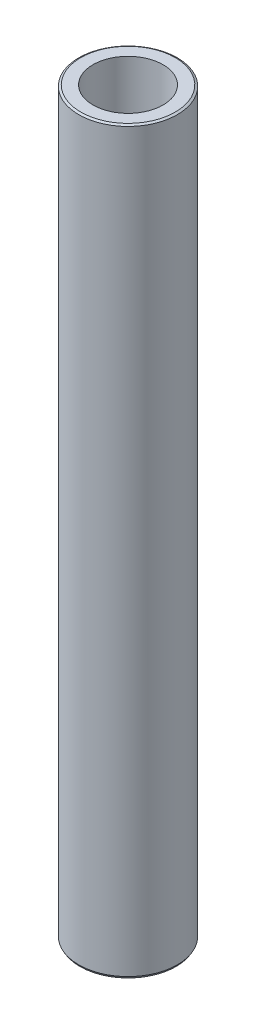
ISO-10303-21;
HEADER;
FILE_DESCRIPTION(('STEP AP214'),'2;1');
FILE_NAME('part.step','',(''),(''),'','','');
FILE_SCHEMA(('AUTOMOTIVE_DESIGN { 1 0 10303 214 1 1 1 1 }'));
ENDSEC;
DATA;
#1=APPLICATION_CONTEXT('core data for automotive mechanical design processes');
#2=APPLICATION_PROTOCOL_DEFINITION('international standard','automotive_design',2000,#1);
#3=PRODUCT_CONTEXT('',#1,'mechanical');
#4=PRODUCT('Part','Part','',(#3));
#5=PRODUCT_RELATED_PRODUCT_CATEGORY('part','',(#4));
#6=PRODUCT_DEFINITION_FORMATION('','',#4);
#7=PRODUCT_DEFINITION_CONTEXT('part definition',#1,'design');
#8=PRODUCT_DEFINITION('design','',#6,#7);
#9=PRODUCT_DEFINITION_SHAPE('','',#8);
#10=(LENGTH_UNIT() NAMED_UNIT(*) SI_UNIT(.MILLI.,.METRE.));
#11=(NAMED_UNIT(*) PLANE_ANGLE_UNIT() SI_UNIT($,.RADIAN.));
#12=(NAMED_UNIT(*) SI_UNIT($,.STERADIAN.) SOLID_ANGLE_UNIT());
#13=UNCERTAINTY_MEASURE_WITH_UNIT(LENGTH_MEASURE(1.E-05),#10,'distance_accuracy_value','');
#14=(GEOMETRIC_REPRESENTATION_CONTEXT(3) GLOBAL_UNCERTAINTY_ASSIGNED_CONTEXT((#13)) GLOBAL_UNIT_ASSIGNED_CONTEXT((#10,
#11,#12)) REPRESENTATION_CONTEXT('',''));
#15=CARTESIAN_POINT('',(0.,0.,0.));
#16=DIRECTION('',(0.,0.,1.));
#17=DIRECTION('',(1.,0.,0.));
#18=AXIS2_PLACEMENT_3D('',#15,#16,#17);
#19=CARTESIAN_POINT('',(0.,600.,0.));
#20=DIRECTION('',(0.,-1.,0.));
#21=DIRECTION('',(0.,0.,-1.));
#22=AXIS2_PLACEMENT_3D('',#19,#20,#21);
#23=CYLINDRICAL_SURFACE('',#22,40.);
#24=CARTESIAN_POINT('',(0.,599.035138265306,0.));
#25=DIRECTION('',(0.,1.,0.));
#26=DIRECTION('',(0.,0.,1.));
#27=AXIS2_PLACEMENT_3D('',#24,#25,#26);
#28=CIRCLE('',#27,40.);
#29=CARTESIAN_POINT('',(0.,599.035138265306,-40.0000000000001));
#30=VERTEX_POINT('',#29);
#31=EDGE_CURVE('E50',#30,#30,#28,.F.);
#32=ORIENTED_EDGE('',*,*,#31,.T.);
#33=EDGE_LOOP('',(#32));
#34=FACE_BOUND('',#33,.T.);
#35=CARTESIAN_POINT('',(0.,1.67118954676815,0.));
#36=DIRECTION('',(0.,1.,0.));
#37=DIRECTION('',(0.,0.,1.));
#38=AXIS2_PLACEMENT_3D('',#35,#36,#37);
#39=CIRCLE('',#38,40.);
#40=CARTESIAN_POINT('',(0.,1.67118954676815,40.));
#41=VERTEX_POINT('',#40);
#42=EDGE_CURVE('E51',#41,#41,#39,.T.);
#43=ORIENTED_EDGE('',*,*,#42,.T.);
#44=EDGE_LOOP('',(#43));
#45=FACE_BOUND('',#44,.T.);
#46=ADVANCED_FACE('F39',(#34,#45),#23,.T.);
#47=CARTESIAN_POINT('',(0.,600.,0.));
#48=DIRECTION('',(0.,1.,0.));
#49=DIRECTION('',(0.,0.,1.));
#50=AXIS2_PLACEMENT_3D('',#47,#48,#49);
#51=PLANE('',#50);
#52=CARTESIAN_POINT('',(0.,600.,0.));
#53=DIRECTION('',(0.,1.,0.));
#54=DIRECTION('',(0.,0.,1.));
#55=AXIS2_PLACEMENT_3D('',#52,#53,#54);
#56=CIRCLE('',#55,38.3288104532313);
#57=CARTESIAN_POINT('',(0.,600.,-38.3288104532314));
#58=VERTEX_POINT('',#57);
#59=EDGE_CURVE('E54',#58,#58,#56,.T.);
#60=ORIENTED_EDGE('',*,*,#59,.T.);
#61=EDGE_LOOP('',(#60));
#62=FACE_BOUND('',#61,.T.);
#63=CARTESIAN_POINT('',(0.,600.,0.));
#64=DIRECTION('',(0.,1.,0.));
#65=DIRECTION('',(0.,0.,1.));
#66=AXIS2_PLACEMENT_3D('',#63,#64,#65);
#67=CIRCLE('',#66,28.4004522430269);
#68=CARTESIAN_POINT('',(0.,600.,28.4004522430269));
#69=VERTEX_POINT('',#68);
#70=EDGE_CURVE('E58',#69,#69,#67,.T.);
#71=ORIENTED_EDGE('',*,*,#70,.F.);
#72=EDGE_LOOP('',(#71));
#73=FACE_BOUND('',#72,.T.);
#74=ADVANCED_FACE('F69',(#62,#73),#51,.T.);
#75=CARTESIAN_POINT('',(0.,0.,0.));
#76=DIRECTION('',(0.,1.,0.));
#77=DIRECTION('',(0.,0.,1.));
#78=AXIS2_PLACEMENT_3D('',#75,#76,#77);
#79=PLANE('',#78);
#80=CARTESIAN_POINT('',(0.,0.,0.));
#81=DIRECTION('',(0.,1.,0.));
#82=DIRECTION('',(0.,0.,1.));
#83=AXIS2_PLACEMENT_3D('',#80,#81,#82);
#84=CIRCLE('',#83,39.0351382653065);
#85=CARTESIAN_POINT('',(0.,0.,39.0351382653065));
#86=VERTEX_POINT('',#85);
#87=EDGE_CURVE('E10',#86,#86,#84,.F.);
#88=ORIENTED_EDGE('',*,*,#87,.T.);
#89=EDGE_LOOP('',(#88));
#90=FACE_BOUND('',#89,.T.);
#91=CARTESIAN_POINT('',(0.,0.,0.));
#92=DIRECTION('',(0.,1.,0.));
#93=DIRECTION('',(0.,0.,1.));
#94=AXIS2_PLACEMENT_3D('',#91,#92,#93);
#95=CIRCLE('',#94,28.4004522430269);
#96=CARTESIAN_POINT('',(0.,0.,28.4004522430269));
#97=VERTEX_POINT('',#96);
#98=EDGE_CURVE('E63',#97,#97,#95,.T.);
#99=ORIENTED_EDGE('',*,*,#98,.T.);
#100=EDGE_LOOP('',(#99));
#101=FACE_BOUND('',#100,.T.);
#102=ADVANCED_FACE('F75',(#90,#101),#79,.F.);
#103=CARTESIAN_POINT('',(0.,600.,0.));
#104=DIRECTION('',(0.,-1.,0.));
#105=DIRECTION('',(0.,0.,-1.));
#106=AXIS2_PLACEMENT_3D('',#103,#104,#105);
#107=CYLINDRICAL_SURFACE('',#106,28.4004522430269);
#108=ORIENTED_EDGE('',*,*,#70,.T.);
#109=EDGE_LOOP('',(#108));
#110=FACE_BOUND('',#109,.T.);
#111=ORIENTED_EDGE('',*,*,#98,.F.);
#112=EDGE_LOOP('',(#111));
#113=FACE_BOUND('',#112,.T.);
#114=ADVANCED_FACE('F70',(#110,#113),#107,.F.);
#115=CARTESIAN_POINT('',(0.,600.,0.));
#116=DIRECTION('',(0.,-1.,0.));
#117=DIRECTION('',(0.,0.,-1.));
#118=AXIS2_PLACEMENT_3D('',#115,#116,#117);
#119=CONICAL_SURFACE('',#118,38.3288104532313,1.04719755119659);
#120=CARTESIAN_POINT('',(0.,599.035138265306,-40.0000000000001));
#121=CARTESIAN_POINT('',(0.,599.045188908376,-39.9825917755546));
#122=CARTESIAN_POINT('',(0.,599.055239551446,-39.9651835511091));
#123=CARTESIAN_POINT('',(0.,599.075340837585,-39.9303671022181));
#124=CARTESIAN_POINT('',(0.,599.085391480655,-39.9129588777726));
#125=CARTESIAN_POINT('',(0.,599.105492766794,-39.8781424288815));
#126=CARTESIAN_POINT('',(0.,599.115543409864,-39.860734204436));
#127=CARTESIAN_POINT('',(0.,599.135644696003,-39.825917755545));
#128=CARTESIAN_POINT('',(0.,599.145695339073,-39.8085095310995));
#129=CARTESIAN_POINT('',(0.,599.165796625212,-39.7736930822085));
#130=CARTESIAN_POINT('',(0.,599.175847268282,-39.756284857763));
#131=CARTESIAN_POINT('',(0.,599.195948554422,-39.721468408872));
#132=CARTESIAN_POINT('',(0.,599.205999197492,-39.7040601844265));
#133=CARTESIAN_POINT('',(0.,599.226100483631,-39.6692437355355));
#134=CARTESIAN_POINT('',(0.,599.236151126701,-39.65183551109));
#135=CARTESIAN_POINT('',(0.,599.25625241284,-39.6170190621989));
#136=CARTESIAN_POINT('',(0.,599.26630305591,-39.5996108377534));
#137=CARTESIAN_POINT('',(0.,599.286404342049,-39.5647943888624));
#138=CARTESIAN_POINT('',(0.,599.296454985119,-39.5473861644169));
#139=CARTESIAN_POINT('',(0.,599.316556271258,-39.5125697155259));
#140=CARTESIAN_POINT('',(0.,599.326606914328,-39.4951614910804));
#141=CARTESIAN_POINT('',(0.,599.346708200468,-39.4603450421894));
#142=CARTESIAN_POINT('',(0.,599.356758843537,-39.4429368177439));
#143=CARTESIAN_POINT('',(0.,599.376860129677,-39.4081203688529));
#144=CARTESIAN_POINT('',(0.,599.386910772747,-39.3907121444074));
#145=CARTESIAN_POINT('',(0.,599.407012058886,-39.3558956955163));
#146=CARTESIAN_POINT('',(0.,599.417062701956,-39.3384874710708));
#147=CARTESIAN_POINT('',(0.,599.437163988095,-39.3036710221798));
#148=CARTESIAN_POINT('',(0.,599.447214631165,-39.2862627977343));
#149=CARTESIAN_POINT('',(0.,599.467315917304,-39.2514463488433));
#150=CARTESIAN_POINT('',(0.,599.477366560374,-39.2340381243978));
#151=CARTESIAN_POINT('',(0.,599.497467846514,-39.1992216755068));
#152=CARTESIAN_POINT('',(0.,599.507518489583,-39.1818134510613));
#153=CARTESIAN_POINT('',(0.,599.527619775723,-39.1469970021703));
#154=CARTESIAN_POINT('',(0.,599.537670418792,-39.1295887777247));
#155=CARTESIAN_POINT('',(0.,599.557771704932,-39.0947723288337));
#156=CARTESIAN_POINT('',(0.,599.567822348002,-39.0773641043882));
#157=CARTESIAN_POINT('',(0.,599.587923634141,-39.0425476554972));
#158=CARTESIAN_POINT('',(0.,599.597974277211,-39.0251394310517));
#159=CARTESIAN_POINT('',(0.,599.61807556335,-38.9903229821607));
#160=CARTESIAN_POINT('',(0.,599.62812620642,-38.9729147577152));
#161=CARTESIAN_POINT('',(0.,599.648227492559,-38.9380983088242));
#162=CARTESIAN_POINT('',(0.,599.658278135629,-38.9206900843787));
#163=CARTESIAN_POINT('',(0.,599.678379421769,-38.8858736354876));
#164=CARTESIAN_POINT('',(0.,599.688430064838,-38.8684654110421));
#165=CARTESIAN_POINT('',(0.,599.708531350978,-38.8336489621511));
#166=CARTESIAN_POINT('',(0.,599.718581994048,-38.8162407377056));
#167=CARTESIAN_POINT('',(0.,599.738683280187,-38.7814242888146));
#168=CARTESIAN_POINT('',(0.,599.748733923257,-38.7640160643691));
#169=CARTESIAN_POINT('',(0.,599.768835209396,-38.7291996154781));
#170=CARTESIAN_POINT('',(0.,599.778885852466,-38.7117913910326));
#171=CARTESIAN_POINT('',(0.,599.798987138605,-38.6769749421416));
#172=CARTESIAN_POINT('',(0.,599.809037781675,-38.6595667176961));
#173=CARTESIAN_POINT('',(0.,599.829139067815,-38.624750268805));
#174=CARTESIAN_POINT('',(0.,599.839189710884,-38.6073420443595));
#175=CARTESIAN_POINT('',(0.,599.859290997024,-38.5725255954685));
#176=CARTESIAN_POINT('',(0.,599.869341640094,-38.555117371023));
#177=CARTESIAN_POINT('',(0.,599.889442926233,-38.520300922132));
#178=CARTESIAN_POINT('',(0.,599.899493569303,-38.5028926976865));
#179=CARTESIAN_POINT('',(0.,599.919594855442,-38.4680762487955));
#180=CARTESIAN_POINT('',(0.,599.929645498512,-38.45066802435));
#181=CARTESIAN_POINT('',(0.,599.949746784651,-38.415851575459));
#182=CARTESIAN_POINT('',(0.,599.959797427721,-38.3984433510135));
#183=CARTESIAN_POINT('',(0.,599.979898713861,-38.3636269021224));
#184=CARTESIAN_POINT('',(0.,599.98994935693,-38.3462186776769));
#185=CARTESIAN_POINT('',(0.,600.,-38.3288104532314));
#186=B_SPLINE_CURVE_WITH_KNOTS('',3,(#120,#121,#122,#123,#124,#125,#126,#127,#128,#129,#130,
#131,#132,#133,#134,#135,#136,#137,#138,#139,#140,#141,#142,#143,#144,#145,#146,#147,#148,#149,
#150,#151,#152,#153,#154,#155,#156,#157,#158,#159,#160,#161,#162,#163,#164,#165,#166,#167,#168,
#169,#170,#171,#172,#173,#174,#175,#176,#177,#178,#179,#180,#181,#182,#183,#184,#185),
.UNSPECIFIED.,.F.,.F.,(4,2,2,2,2,2,2,2,2,2,2,2,2,2,2,2,2,2,2,2,2,2,2,2,2,2,2,2,2,2,2,2,4),(0.,
0.0603038584183103,0.120607716836676,0.180911575255042,0.241215433673402,0.301519292091767,
0.361823150510133,0.422127008928499,0.482430867346865,0.542734725765231,0.603038584183596,
0.663342442601956,0.723646301020322,0.783950159438688,0.844254017857053,0.904557876275419,
0.964861734693785,1.02516559311209,1.08546945153045,1.14577330994882,1.20607716836719,
1.26638102678555,1.32668488520392,1.38698874362228,1.44729260204064,1.50759646045901,
1.56790031887737,1.62820417729574,1.68850803571411,1.74881189413247,1.80911575255083,
1.8694196109692,1.92972346938756),.UNSPECIFIED.);
#187=EDGE_CURVE('BSEAM81',#30,#58,#186,.T.);
#188=ORIENTED_EDGE('',*,*,#31,.F.);
#189=ORIENTED_EDGE('',*,*,#59,.F.);
#190=ORIENTED_EDGE('',*,*,#187,.T.);
#191=ORIENTED_EDGE('',*,*,#187,.F.);
#192=EDGE_LOOP('',(#188,#190,#189,#191));
#193=FACE_BOUND('',#192,.T.);
#194=ADVANCED_FACE('F81',(#193),#119,.T.);
#195=CARTESIAN_POINT('',(0.,1.67118954676815,0.));
#196=DIRECTION('',(0.,1.,0.));
#197=DIRECTION('',(0.,0.,1.));
#198=AXIS2_PLACEMENT_3D('',#195,#196,#197);
#199=CONICAL_SURFACE('',#198,40.,0.523598775598323);
#200=ORIENTED_EDGE('',*,*,#87,.F.);
#201=EDGE_LOOP('',(#200));
#202=FACE_BOUND('',#201,.T.);
#203=ORIENTED_EDGE('',*,*,#42,.F.);
#204=EDGE_LOOP('',(#203));
#205=FACE_BOUND('',#204,.T.);
#206=ADVANCED_FACE('F45',(#202,#205),#199,.T.);
#207=CLOSED_SHELL('',(#46,#74,#102,#114,#194,#206));
#208=MANIFOLD_SOLID_BREP('B2',#207);
#209=ADVANCED_BREP_SHAPE_REPRESENTATION('',(#18,#208),#14);
#210=SHAPE_DEFINITION_REPRESENTATION(#9,#209);
ENDSEC;
END-ISO-10303-21;
